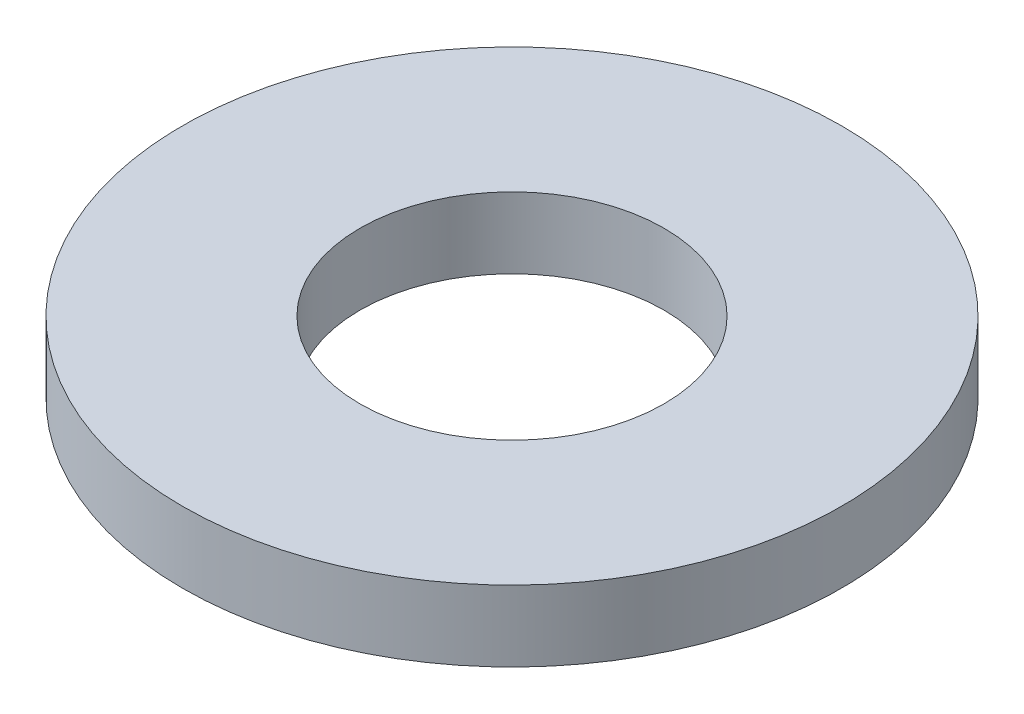
ISO-10303-21;
HEADER;
FILE_DESCRIPTION(('STEP AP214'),'2;1');
FILE_NAME('part.step','',(''),(''),'','','');
FILE_SCHEMA(('AUTOMOTIVE_DESIGN { 1 0 10303 214 1 1 1 1 }'));
ENDSEC;
DATA;
#1=APPLICATION_CONTEXT('core data for automotive mechanical design processes');
#2=APPLICATION_PROTOCOL_DEFINITION('international standard','automotive_design',2000,#1);
#3=PRODUCT_CONTEXT('',#1,'mechanical');
#4=PRODUCT('Part','Part','',(#3));
#5=PRODUCT_RELATED_PRODUCT_CATEGORY('part','',(#4));
#6=PRODUCT_DEFINITION_FORMATION('','',#4);
#7=PRODUCT_DEFINITION_CONTEXT('part definition',#1,'design');
#8=PRODUCT_DEFINITION('design','',#6,#7);
#9=PRODUCT_DEFINITION_SHAPE('','',#8);
#10=(LENGTH_UNIT() NAMED_UNIT(*) SI_UNIT(.MILLI.,.METRE.));
#11=(NAMED_UNIT(*) PLANE_ANGLE_UNIT() SI_UNIT($,.RADIAN.));
#12=(NAMED_UNIT(*) SI_UNIT($,.STERADIAN.) SOLID_ANGLE_UNIT());
#13=UNCERTAINTY_MEASURE_WITH_UNIT(LENGTH_MEASURE(1.E-05),#10,'distance_accuracy_value','');
#14=(GEOMETRIC_REPRESENTATION_CONTEXT(3) GLOBAL_UNCERTAINTY_ASSIGNED_CONTEXT((#13)) GLOBAL_UNIT_ASSIGNED_CONTEXT((#10,
#11,#12)) REPRESENTATION_CONTEXT('',''));
#15=CARTESIAN_POINT('',(0.,0.,0.));
#16=DIRECTION('',(0.,0.,1.));
#17=DIRECTION('',(1.,0.,0.));
#18=AXIS2_PLACEMENT_3D('',#15,#16,#17);
#19=CARTESIAN_POINT('',(0.,14.,0.));
#20=DIRECTION('',(0.,-1.,0.));
#21=DIRECTION('',(0.,0.,-1.));
#22=AXIS2_PLACEMENT_3D('',#19,#20,#21);
#23=CYLINDRICAL_SURFACE('',#22,65.);
#24=CARTESIAN_POINT('',(0.,14.,0.));
#25=DIRECTION('',(0.,1.,0.));
#26=DIRECTION('',(0.,0.,1.));
#27=AXIS2_PLACEMENT_3D('',#24,#25,#26);
#28=CIRCLE('',#27,65.);
#29=CARTESIAN_POINT('',(0.,14.,65.));
#30=VERTEX_POINT('',#29);
#31=EDGE_CURVE('E10',#30,#30,#28,.T.);
#32=ORIENTED_EDGE('',*,*,#31,.F.);
#33=EDGE_LOOP('',(#32));
#34=FACE_BOUND('',#33,.T.);
#35=CARTESIAN_POINT('',(0.,0.,0.));
#36=DIRECTION('',(0.,1.,0.));
#37=DIRECTION('',(0.,0.,1.));
#38=AXIS2_PLACEMENT_3D('',#35,#36,#37);
#39=CIRCLE('',#38,65.);
#40=CARTESIAN_POINT('',(0.,0.,65.));
#41=VERTEX_POINT('',#40);
#42=EDGE_CURVE('E37',#41,#41,#39,.T.);
#43=ORIENTED_EDGE('',*,*,#42,.T.);
#44=EDGE_LOOP('',(#43));
#45=FACE_BOUND('',#44,.T.);
#46=ADVANCED_FACE('F40',(#34,#45),#23,.T.);
#47=CARTESIAN_POINT('',(0.,14.,0.));
#48=DIRECTION('',(0.,1.,0.));
#49=DIRECTION('',(0.,0.,1.));
#50=AXIS2_PLACEMENT_3D('',#47,#48,#49);
#51=PLANE('',#50);
#52=CARTESIAN_POINT('',(0.,14.,0.));
#53=DIRECTION('',(0.,1.,0.));
#54=DIRECTION('',(0.,0.,1.));
#55=AXIS2_PLACEMENT_3D('',#52,#53,#54);
#56=CIRCLE('',#55,30.);
#57=CARTESIAN_POINT('',(0.,14.,30.));
#58=VERTEX_POINT('',#57);
#59=EDGE_CURVE('E50',#58,#58,#56,.T.);
#60=ORIENTED_EDGE('',*,*,#59,.F.);
#61=EDGE_LOOP('',(#60));
#62=FACE_BOUND('',#61,.T.);
#63=ORIENTED_EDGE('',*,*,#31,.T.);
#64=EDGE_LOOP('',(#63));
#65=FACE_BOUND('',#64,.T.);
#66=ADVANCED_FACE('F59',(#62,#65),#51,.T.);
#67=CARTESIAN_POINT('',(0.,0.,0.));
#68=DIRECTION('',(0.,1.,0.));
#69=DIRECTION('',(0.,0.,1.));
#70=AXIS2_PLACEMENT_3D('',#67,#68,#69);
#71=PLANE('',#70);
#72=CARTESIAN_POINT('',(0.,0.,0.));
#73=DIRECTION('',(0.,1.,0.));
#74=DIRECTION('',(0.,0.,1.));
#75=AXIS2_PLACEMENT_3D('',#72,#73,#74);
#76=CIRCLE('',#75,30.);
#77=CARTESIAN_POINT('',(0.,0.,30.));
#78=VERTEX_POINT('',#77);
#79=EDGE_CURVE('E47',#78,#78,#76,.T.);
#80=ORIENTED_EDGE('',*,*,#79,.T.);
#81=EDGE_LOOP('',(#80));
#82=FACE_BOUND('',#81,.T.);
#83=ORIENTED_EDGE('',*,*,#42,.F.);
#84=EDGE_LOOP('',(#83));
#85=FACE_BOUND('',#84,.T.);
#86=ADVANCED_FACE('F58',(#82,#85),#71,.F.);
#87=CARTESIAN_POINT('',(0.,14.,0.));
#88=DIRECTION('',(0.,-1.,0.));
#89=DIRECTION('',(0.,0.,-1.));
#90=AXIS2_PLACEMENT_3D('',#87,#88,#89);
#91=CYLINDRICAL_SURFACE('',#90,30.);
#92=ORIENTED_EDGE('',*,*,#59,.T.);
#93=EDGE_LOOP('',(#92));
#94=FACE_BOUND('',#93,.T.);
#95=ORIENTED_EDGE('',*,*,#79,.F.);
#96=EDGE_LOOP('',(#95));
#97=FACE_BOUND('',#96,.T.);
#98=ADVANCED_FACE('F54',(#94,#97),#91,.F.);
#99=CLOSED_SHELL('',(#46,#66,#86,#98));
#100=MANIFOLD_SOLID_BREP('B2',#99);
#101=ADVANCED_BREP_SHAPE_REPRESENTATION('',(#18,#100),#14);
#102=SHAPE_DEFINITION_REPRESENTATION(#9,#101);
ENDSEC;
END-ISO-10303-21;
